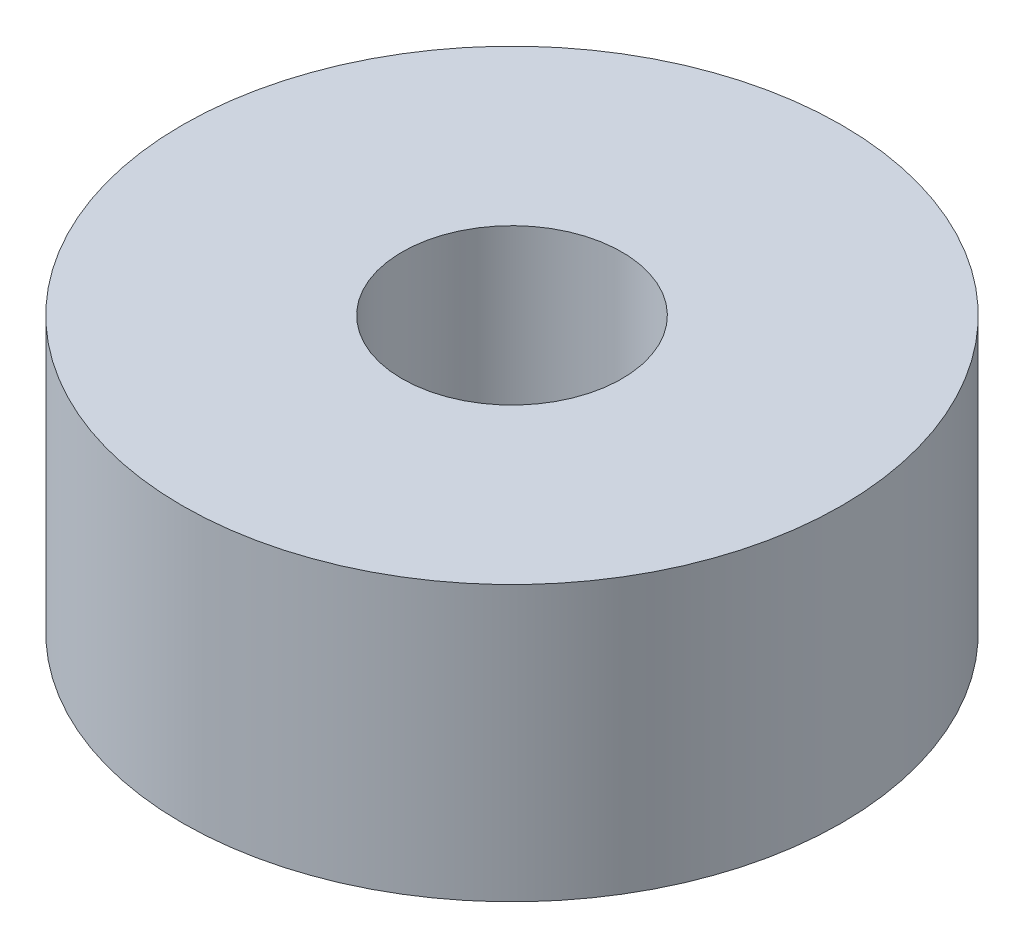
ISO-10303-21;
HEADER;
FILE_DESCRIPTION(('STEP AP214'),'2;1');
FILE_NAME('part.step','',(''),(''),'','','');
FILE_SCHEMA(('AUTOMOTIVE_DESIGN { 1 0 10303 214 1 1 1 1 }'));
ENDSEC;
DATA;
#1=APPLICATION_CONTEXT('core data for automotive mechanical design processes');
#2=APPLICATION_PROTOCOL_DEFINITION('international standard','automotive_design',2000,#1);
#3=PRODUCT_CONTEXT('',#1,'mechanical');
#4=PRODUCT('Part','Part','',(#3));
#5=PRODUCT_RELATED_PRODUCT_CATEGORY('part','',(#4));
#6=PRODUCT_DEFINITION_FORMATION('','',#4);
#7=PRODUCT_DEFINITION_CONTEXT('part definition',#1,'design');
#8=PRODUCT_DEFINITION('design','',#6,#7);
#9=PRODUCT_DEFINITION_SHAPE('','',#8);
#10=(LENGTH_UNIT() NAMED_UNIT(*) SI_UNIT(.MILLI.,.METRE.));
#11=(NAMED_UNIT(*) PLANE_ANGLE_UNIT() SI_UNIT($,.RADIAN.));
#12=(NAMED_UNIT(*) SI_UNIT($,.STERADIAN.) SOLID_ANGLE_UNIT());
#13=UNCERTAINTY_MEASURE_WITH_UNIT(LENGTH_MEASURE(1.E-05),#10,'distance_accuracy_value','');
#14=(GEOMETRIC_REPRESENTATION_CONTEXT(3) GLOBAL_UNCERTAINTY_ASSIGNED_CONTEXT((#13)) GLOBAL_UNIT_ASSIGNED_CONTEXT((#10,
#11,#12)) REPRESENTATION_CONTEXT('',''));
#15=CARTESIAN_POINT('',(0.,0.,0.));
#16=DIRECTION('',(0.,0.,1.));
#17=DIRECTION('',(1.,0.,0.));
#18=AXIS2_PLACEMENT_3D('',#15,#16,#17);
#19=CARTESIAN_POINT('',(0.,2.5,0.));
#20=DIRECTION('',(0.,1.,0.));
#21=DIRECTION('',(0.,0.,1.));
#22=AXIS2_PLACEMENT_3D('',#19,#20,#21);
#23=PLANE('',#22);
#24=CARTESIAN_POINT('',(0.,2.5,0.));
#25=DIRECTION('',(0.,1.,0.));
#26=DIRECTION('',(0.,0.,1.));
#27=AXIS2_PLACEMENT_3D('',#24,#25,#26);
#28=CIRCLE('',#27,3.);
#29=CARTESIAN_POINT('',(0.,2.5,3.));
#30=VERTEX_POINT('',#29);
#31=EDGE_CURVE('E10',#30,#30,#28,.T.);
#32=ORIENTED_EDGE('',*,*,#31,.T.);
#33=EDGE_LOOP('',(#32));
#34=FACE_BOUND('',#33,.T.);
#35=CARTESIAN_POINT('',(0.,2.5,0.));
#36=DIRECTION('',(0.,1.,0.));
#37=DIRECTION('',(0.,0.,1.));
#38=AXIS2_PLACEMENT_3D('',#35,#36,#37);
#39=CIRCLE('',#38,1.);
#40=CARTESIAN_POINT('',(0.,2.5,1.));
#41=VERTEX_POINT('',#40);
#42=EDGE_CURVE('E48',#41,#41,#39,.T.);
#43=ORIENTED_EDGE('',*,*,#42,.F.);
#44=EDGE_LOOP('',(#43));
#45=FACE_BOUND('',#44,.T.);
#46=ADVANCED_FACE('F37',(#34,#45),#23,.T.);
#47=CARTESIAN_POINT('',(0.,0.,0.));
#48=DIRECTION('',(0.,1.,0.));
#49=DIRECTION('',(0.,0.,1.));
#50=AXIS2_PLACEMENT_3D('',#47,#48,#49);
#51=PLANE('',#50);
#52=CARTESIAN_POINT('',(0.,0.,0.));
#53=DIRECTION('',(0.,1.,0.));
#54=DIRECTION('',(0.,0.,1.));
#55=AXIS2_PLACEMENT_3D('',#52,#53,#54);
#56=CIRCLE('',#55,3.);
#57=CARTESIAN_POINT('',(0.,0.,3.));
#58=VERTEX_POINT('',#57);
#59=EDGE_CURVE('E41',#58,#58,#56,.T.);
#60=ORIENTED_EDGE('',*,*,#59,.F.);
#61=EDGE_LOOP('',(#60));
#62=FACE_BOUND('',#61,.T.);
#63=CARTESIAN_POINT('',(0.,0.,0.));
#64=DIRECTION('',(0.,1.,0.));
#65=DIRECTION('',(0.,0.,1.));
#66=AXIS2_PLACEMENT_3D('',#63,#64,#65);
#67=CIRCLE('',#66,1.);
#68=CARTESIAN_POINT('',(0.,0.,1.));
#69=VERTEX_POINT('',#68);
#70=EDGE_CURVE('E50',#69,#69,#67,.T.);
#71=ORIENTED_EDGE('',*,*,#70,.T.);
#72=EDGE_LOOP('',(#71));
#73=FACE_BOUND('',#72,.T.);
#74=ADVANCED_FACE('F60',(#62,#73),#51,.F.);
#75=CARTESIAN_POINT('',(0.,2.5,0.));
#76=DIRECTION('',(0.,-1.,0.));
#77=DIRECTION('',(0.,0.,-1.));
#78=AXIS2_PLACEMENT_3D('',#75,#76,#77);
#79=CYLINDRICAL_SURFACE('',#78,3.);
#80=ORIENTED_EDGE('',*,*,#31,.F.);
#81=EDGE_LOOP('',(#80));
#82=FACE_BOUND('',#81,.T.);
#83=ORIENTED_EDGE('',*,*,#59,.T.);
#84=EDGE_LOOP('',(#83));
#85=FACE_BOUND('',#84,.T.);
#86=ADVANCED_FACE('F39',(#82,#85),#79,.T.);
#87=CARTESIAN_POINT('',(0.,2.5,0.));
#88=DIRECTION('',(0.,-1.,0.));
#89=DIRECTION('',(0.,0.,-1.));
#90=AXIS2_PLACEMENT_3D('',#87,#88,#89);
#91=CYLINDRICAL_SURFACE('',#90,1.);
#92=ORIENTED_EDGE('',*,*,#42,.T.);
#93=EDGE_LOOP('',(#92));
#94=FACE_BOUND('',#93,.T.);
#95=ORIENTED_EDGE('',*,*,#70,.F.);
#96=EDGE_LOOP('',(#95));
#97=FACE_BOUND('',#96,.T.);
#98=ADVANCED_FACE('F56',(#94,#97),#91,.F.);
#99=CLOSED_SHELL('',(#46,#74,#86,#98));
#100=MANIFOLD_SOLID_BREP('B2',#99);
#101=ADVANCED_BREP_SHAPE_REPRESENTATION('',(#18,#100),#14);
#102=SHAPE_DEFINITION_REPRESENTATION(#9,#101);
ENDSEC;
END-ISO-10303-21;
